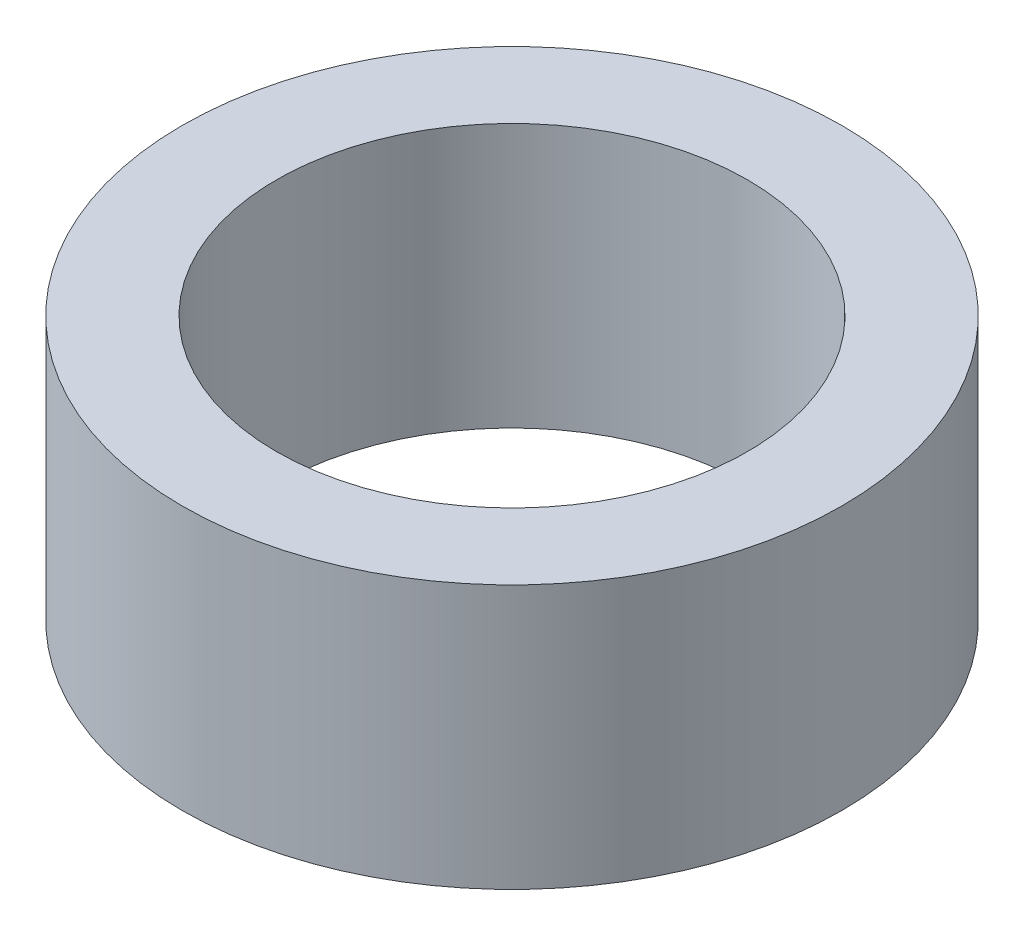
ISO-10303-21;
HEADER;
FILE_DESCRIPTION(('STEP AP214'),'2;1');
FILE_NAME('part.step','',(''),(''),'','','');
FILE_SCHEMA(('AUTOMOTIVE_DESIGN { 1 0 10303 214 1 1 1 1 }'));
ENDSEC;
DATA;
#1=APPLICATION_CONTEXT('core data for automotive mechanical design processes');
#2=APPLICATION_PROTOCOL_DEFINITION('international standard','automotive_design',2000,#1);
#3=PRODUCT_CONTEXT('',#1,'mechanical');
#4=PRODUCT('Part','Part','',(#3));
#5=PRODUCT_RELATED_PRODUCT_CATEGORY('part','',(#4));
#6=PRODUCT_DEFINITION_FORMATION('','',#4);
#7=PRODUCT_DEFINITION_CONTEXT('part definition',#1,'design');
#8=PRODUCT_DEFINITION('design','',#6,#7);
#9=PRODUCT_DEFINITION_SHAPE('','',#8);
#10=(LENGTH_UNIT() NAMED_UNIT(*) SI_UNIT(.MILLI.,.METRE.));
#11=(NAMED_UNIT(*) PLANE_ANGLE_UNIT() SI_UNIT($,.RADIAN.));
#12=(NAMED_UNIT(*) SI_UNIT($,.STERADIAN.) SOLID_ANGLE_UNIT());
#13=UNCERTAINTY_MEASURE_WITH_UNIT(LENGTH_MEASURE(1.E-05),#10,'distance_accuracy_value','');
#14=(GEOMETRIC_REPRESENTATION_CONTEXT(3) GLOBAL_UNCERTAINTY_ASSIGNED_CONTEXT((#13)) GLOBAL_UNIT_ASSIGNED_CONTEXT((#10,
#11,#12)) REPRESENTATION_CONTEXT('',''));
#15=CARTESIAN_POINT('',(0.,0.,0.));
#16=DIRECTION('',(0.,0.,1.));
#17=DIRECTION('',(1.,0.,0.));
#18=AXIS2_PLACEMENT_3D('',#15,#16,#17);
#19=CARTESIAN_POINT('',(0.,-4.445,0.));
#20=DIRECTION('',(0.,1.,0.));
#21=DIRECTION('',(0.,0.,1.));
#22=AXIS2_PLACEMENT_3D('',#19,#20,#21);
#23=CYLINDRICAL_SURFACE('',#22,5.55625);
#24=CARTESIAN_POINT('',(0.,-4.445,0.));
#25=DIRECTION('',(0.,1.,0.));
#26=DIRECTION('',(0.,0.,1.));
#27=AXIS2_PLACEMENT_3D('',#24,#25,#26);
#28=CIRCLE('',#27,5.55625);
#29=CARTESIAN_POINT('',(0.,-4.445,5.55625));
#30=VERTEX_POINT('',#29);
#31=EDGE_CURVE('E10',#30,#30,#28,.T.);
#32=ORIENTED_EDGE('',*,*,#31,.T.);
#33=EDGE_LOOP('',(#32));
#34=FACE_BOUND('',#33,.T.);
#35=CARTESIAN_POINT('',(0.,0.,0.));
#36=DIRECTION('',(0.,1.,0.));
#37=DIRECTION('',(0.,0.,1.));
#38=AXIS2_PLACEMENT_3D('',#35,#36,#37);
#39=CIRCLE('',#38,5.55625);
#40=CARTESIAN_POINT('',(0.,0.,5.55625));
#41=VERTEX_POINT('',#40);
#42=EDGE_CURVE('E37',#41,#41,#39,.T.);
#43=ORIENTED_EDGE('',*,*,#42,.F.);
#44=EDGE_LOOP('',(#43));
#45=FACE_BOUND('',#44,.T.);
#46=ADVANCED_FACE('F34',(#34,#45),#23,.T.);
#47=CARTESIAN_POINT('',(0.,-4.445,0.));
#48=DIRECTION('',(0.,1.,0.));
#49=DIRECTION('',(0.,0.,1.));
#50=AXIS2_PLACEMENT_3D('',#47,#48,#49);
#51=PLANE('',#50);
#52=CARTESIAN_POINT('',(0.,-4.445,0.));
#53=DIRECTION('',(0.,1.,0.));
#54=DIRECTION('',(0.,0.,1.));
#55=AXIS2_PLACEMENT_3D('',#52,#53,#54);
#56=CIRCLE('',#55,3.96875);
#57=CARTESIAN_POINT('',(0.,-4.445,3.96875));
#58=VERTEX_POINT('',#57);
#59=EDGE_CURVE('E44',#58,#58,#56,.T.);
#60=ORIENTED_EDGE('',*,*,#59,.T.);
#61=EDGE_LOOP('',(#60));
#62=FACE_BOUND('',#61,.T.);
#63=ORIENTED_EDGE('',*,*,#31,.F.);
#64=EDGE_LOOP('',(#63));
#65=FACE_BOUND('',#64,.T.);
#66=ADVANCED_FACE('F52',(#62,#65),#51,.F.);
#67=CARTESIAN_POINT('',(0.,0.,0.));
#68=DIRECTION('',(0.,1.,0.));
#69=DIRECTION('',(0.,0.,1.));
#70=AXIS2_PLACEMENT_3D('',#67,#68,#69);
#71=PLANE('',#70);
#72=CARTESIAN_POINT('',(0.,0.,0.));
#73=DIRECTION('',(0.,1.,0.));
#74=DIRECTION('',(0.,0.,1.));
#75=AXIS2_PLACEMENT_3D('',#72,#73,#74);
#76=CIRCLE('',#75,3.96875);
#77=CARTESIAN_POINT('',(0.,0.,3.96875));
#78=VERTEX_POINT('',#77);
#79=EDGE_CURVE('E46',#78,#78,#76,.T.);
#80=ORIENTED_EDGE('',*,*,#79,.F.);
#81=EDGE_LOOP('',(#80));
#82=FACE_BOUND('',#81,.T.);
#83=ORIENTED_EDGE('',*,*,#42,.T.);
#84=EDGE_LOOP('',(#83));
#85=FACE_BOUND('',#84,.T.);
#86=ADVANCED_FACE('F58',(#82,#85),#71,.T.);
#87=CARTESIAN_POINT('',(0.,-4.445,0.));
#88=DIRECTION('',(0.,1.,0.));
#89=DIRECTION('',(0.,0.,1.));
#90=AXIS2_PLACEMENT_3D('',#87,#88,#89);
#91=CYLINDRICAL_SURFACE('',#90,3.96875);
#92=ORIENTED_EDGE('',*,*,#59,.F.);
#93=EDGE_LOOP('',(#92));
#94=FACE_BOUND('',#93,.T.);
#95=ORIENTED_EDGE('',*,*,#79,.T.);
#96=EDGE_LOOP('',(#95));
#97=FACE_BOUND('',#96,.T.);
#98=ADVANCED_FACE('F55',(#94,#97),#91,.F.);
#99=CLOSED_SHELL('',(#46,#66,#86,#98));
#100=MANIFOLD_SOLID_BREP('B2',#99);
#101=ADVANCED_BREP_SHAPE_REPRESENTATION('',(#18,#100),#14);
#102=SHAPE_DEFINITION_REPRESENTATION(#9,#101);
ENDSEC;
END-ISO-10303-21;
